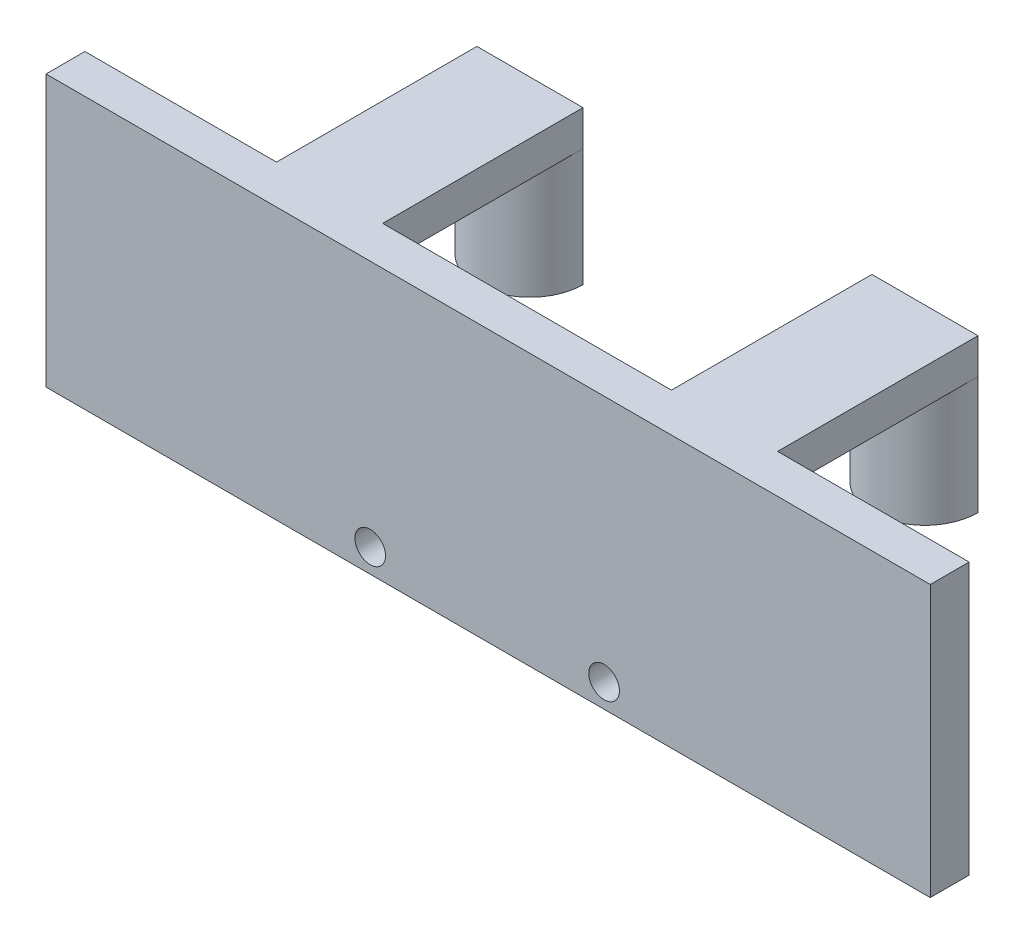
ISO-10303-21;
HEADER;
FILE_DESCRIPTION(('STEP AP214'),'2;1');
FILE_NAME('part.step','',(''),(''),'','','');
FILE_SCHEMA(('AUTOMOTIVE_DESIGN { 1 0 10303 214 1 1 1 1 }'));
ENDSEC;
DATA;
#1=APPLICATION_CONTEXT('core data for automotive mechanical design processes');
#2=APPLICATION_PROTOCOL_DEFINITION('international standard','automotive_design',2000,#1);
#3=PRODUCT_CONTEXT('',#1,'mechanical');
#4=PRODUCT('Part','Part','',(#3));
#5=PRODUCT_RELATED_PRODUCT_CATEGORY('part','',(#4));
#6=PRODUCT_DEFINITION_FORMATION('','',#4);
#7=PRODUCT_DEFINITION_CONTEXT('part definition',#1,'design');
#8=PRODUCT_DEFINITION('design','',#6,#7);
#9=PRODUCT_DEFINITION_SHAPE('','',#8);
#10=(LENGTH_UNIT() NAMED_UNIT(*) SI_UNIT(.MILLI.,.METRE.));
#11=(NAMED_UNIT(*) PLANE_ANGLE_UNIT() SI_UNIT($,.RADIAN.));
#12=(NAMED_UNIT(*) SI_UNIT($,.STERADIAN.) SOLID_ANGLE_UNIT());
#13=UNCERTAINTY_MEASURE_WITH_UNIT(LENGTH_MEASURE(1.E-05),#10,'distance_accuracy_value','');
#14=(GEOMETRIC_REPRESENTATION_CONTEXT(3) GLOBAL_UNCERTAINTY_ASSIGNED_CONTEXT((#13)) GLOBAL_UNIT_ASSIGNED_CONTEXT((#10,
#11,#12)) REPRESENTATION_CONTEXT('',''));
#15=CARTESIAN_POINT('',(0.,0.,0.));
#16=DIRECTION('',(0.,0.,1.));
#17=DIRECTION('',(1.,0.,0.));
#18=AXIS2_PLACEMENT_3D('',#15,#16,#17);
#19=CARTESIAN_POINT('',(0.,23.,-3.29999999999999));
#20=DIRECTION('',(-1.,0.,0.));
#21=DIRECTION('',(0.,0.,1.));
#22=AXIS2_PLACEMENT_3D('',#19,#20,#21);
#23=PLANE('',#22);
#24=DIRECTION('',(0.,0.,1.));
#25=VECTOR('',#24,1.);
#26=CARTESIAN_POINT('',(0.,20.,0.));
#27=LINE('',#26,#25);
#28=CARTESIAN_POINT('',(0.,20.,-20.3));
#29=VERTEX_POINT('',#28);
#30=CARTESIAN_POINT('',(0.,20.,-3.29999999999999));
#31=VERTEX_POINT('',#30);
#32=EDGE_CURVE('E155',#29,#31,#27,.T.);
#33=ORIENTED_EDGE('',*,*,#32,.F.);
#34=DIRECTION('',(0.,-1.,0.));
#35=VECTOR('',#34,1.);
#36=CARTESIAN_POINT('',(0.,23.,-20.3));
#37=LINE('',#36,#35);
#38=CARTESIAN_POINT('',(0.,23.,-20.3));
#39=VERTEX_POINT('',#38);
#40=EDGE_CURVE('E221',#39,#29,#37,.T.);
#41=ORIENTED_EDGE('',*,*,#40,.F.);
#42=DIRECTION('',(0.,0.,-1.));
#43=VECTOR('',#42,1.);
#44=CARTESIAN_POINT('',(0.,23.,-3.29999999999999));
#45=LINE('',#44,#43);
#46=CARTESIAN_POINT('',(0.,23.,-3.29999999999999));
#47=VERTEX_POINT('',#46);
#48=EDGE_CURVE('E170',#47,#39,#45,.T.);
#49=ORIENTED_EDGE('',*,*,#48,.F.);
#50=DIRECTION('',(0.,-1.,0.));
#51=VECTOR('',#50,1.);
#52=CARTESIAN_POINT('',(0.,23.,-3.29999999999999));
#53=LINE('',#52,#51);
#54=EDGE_CURVE('E224',#47,#31,#53,.T.);
#55=ORIENTED_EDGE('',*,*,#54,.T.);
#56=EDGE_LOOP('',(#33,#41,#49,#55));
#57=FACE_BOUND('',#56,.T.);
#58=ADVANCED_FACE('F36',(#57),#23,.F.);
#59=CARTESIAN_POINT('',(-9.,23.,-20.3));
#60=DIRECTION('',(1.,0.,0.));
#61=DIRECTION('',(0.,0.,-1.));
#62=AXIS2_PLACEMENT_3D('',#59,#60,#61);
#63=PLANE('',#62);
#64=DIRECTION('',(0.,0.,-1.));
#65=VECTOR('',#64,1.);
#66=CARTESIAN_POINT('',(-9.,20.,0.));
#67=LINE('',#66,#65);
#68=CARTESIAN_POINT('',(-9.,20.,-3.29999999999999));
#69=VERTEX_POINT('',#68);
#70=CARTESIAN_POINT('',(-9.,20.,-20.3));
#71=VERTEX_POINT('',#70);
#72=EDGE_CURVE('E267',#69,#71,#67,.T.);
#73=ORIENTED_EDGE('',*,*,#72,.F.);
#74=DIRECTION('',(0.,-1.,0.));
#75=VECTOR('',#74,1.);
#76=CARTESIAN_POINT('',(-9.,23.,-3.29999999999999));
#77=LINE('',#76,#75);
#78=CARTESIAN_POINT('',(-9.,23.,-3.29999999999999));
#79=VERTEX_POINT('',#78);
#80=EDGE_CURVE('E215',#79,#69,#77,.T.);
#81=ORIENTED_EDGE('',*,*,#80,.F.);
#82=DIRECTION('',(0.,0.,1.));
#83=VECTOR('',#82,1.);
#84=CARTESIAN_POINT('',(-9.,23.,-20.3));
#85=LINE('',#84,#83);
#86=CARTESIAN_POINT('',(-9.,23.,-20.3));
#87=VERTEX_POINT('',#86);
#88=EDGE_CURVE('E174',#87,#79,#85,.T.);
#89=ORIENTED_EDGE('',*,*,#88,.F.);
#90=DIRECTION('',(0.,-1.,0.));
#91=VECTOR('',#90,1.);
#92=CARTESIAN_POINT('',(-9.,23.,-20.3));
#93=LINE('',#92,#91);
#94=EDGE_CURVE('E218',#87,#71,#93,.T.);
#95=ORIENTED_EDGE('',*,*,#94,.T.);
#96=EDGE_LOOP('',(#73,#81,#89,#95));
#97=FACE_BOUND('',#96,.T.);
#98=ADVANCED_FACE('F314',(#97),#63,.F.);
#99=CARTESIAN_POINT('',(-33.5,23.,-20.3));
#100=DIRECTION('',(-1.,0.,0.));
#101=DIRECTION('',(0.,0.,1.));
#102=AXIS2_PLACEMENT_3D('',#99,#100,#101);
#103=PLANE('',#102);
#104=DIRECTION('',(0.,0.,1.));
#105=VECTOR('',#104,1.);
#106=CARTESIAN_POINT('',(-33.5,20.,0.));
#107=LINE('',#106,#105);
#108=CARTESIAN_POINT('',(-33.5,20.,-20.3));
#109=VERTEX_POINT('',#108);
#110=CARTESIAN_POINT('',(-33.5,20.,-3.29999999999999));
#111=VERTEX_POINT('',#110);
#112=EDGE_CURVE('E259',#109,#111,#107,.T.);
#113=ORIENTED_EDGE('',*,*,#112,.F.);
#114=DIRECTION('',(0.,-1.,0.));
#115=VECTOR('',#114,1.);
#116=CARTESIAN_POINT('',(-33.5,23.,-20.3));
#117=LINE('',#116,#115);
#118=CARTESIAN_POINT('',(-33.5,23.,-20.3));
#119=VERTEX_POINT('',#118);
#120=EDGE_CURVE('E210',#119,#109,#117,.T.);
#121=ORIENTED_EDGE('',*,*,#120,.F.);
#122=DIRECTION('',(0.,0.,-1.));
#123=VECTOR('',#122,1.);
#124=CARTESIAN_POINT('',(-33.5,23.,-20.3));
#125=LINE('',#124,#123);
#126=CARTESIAN_POINT('',(-33.5,23.,-3.29999999999999));
#127=VERTEX_POINT('',#126);
#128=EDGE_CURVE('E178',#127,#119,#125,.T.);
#129=ORIENTED_EDGE('',*,*,#128,.F.);
#130=DIRECTION('',(0.,-1.,0.));
#131=VECTOR('',#130,1.);
#132=CARTESIAN_POINT('',(-33.5,23.,-3.29999999999999));
#133=LINE('',#132,#131);
#134=EDGE_CURVE('E212',#127,#111,#133,.T.);
#135=ORIENTED_EDGE('',*,*,#134,.T.);
#136=EDGE_LOOP('',(#113,#121,#129,#135));
#137=FACE_BOUND('',#136,.T.);
#138=ADVANCED_FACE('F319',(#137),#103,.F.);
#139=CARTESIAN_POINT('',(-42.5,23.,-3.29999999999999));
#140=DIRECTION('',(1.,0.,0.));
#141=DIRECTION('',(0.,0.,-1.));
#142=AXIS2_PLACEMENT_3D('',#139,#140,#141);
#143=PLANE('',#142);
#144=DIRECTION('',(0.,0.,-1.));
#145=VECTOR('',#144,1.);
#146=CARTESIAN_POINT('',(-42.5,20.,0.));
#147=LINE('',#146,#145);
#148=CARTESIAN_POINT('',(-42.5,20.,-3.29999999999999));
#149=VERTEX_POINT('',#148);
#150=CARTESIAN_POINT('',(-42.5,20.,-20.3));
#151=VERTEX_POINT('',#150);
#152=EDGE_CURVE('E157',#149,#151,#147,.T.);
#153=ORIENTED_EDGE('',*,*,#152,.F.);
#154=DIRECTION('',(0.,-1.,0.));
#155=VECTOR('',#154,1.);
#156=CARTESIAN_POINT('',(-42.5,23.,-3.29999999999999));
#157=LINE('',#156,#155);
#158=CARTESIAN_POINT('',(-42.5,23.,-3.29999999999999));
#159=VERTEX_POINT('',#158);
#160=EDGE_CURVE('E205',#159,#149,#157,.T.);
#161=ORIENTED_EDGE('',*,*,#160,.F.);
#162=DIRECTION('',(0.,0.,1.));
#163=VECTOR('',#162,1.);
#164=CARTESIAN_POINT('',(-42.5,23.,-3.29999999999999));
#165=LINE('',#164,#163);
#166=CARTESIAN_POINT('',(-42.5,23.,-20.3));
#167=VERTEX_POINT('',#166);
#168=EDGE_CURVE('E182',#167,#159,#165,.T.);
#169=ORIENTED_EDGE('',*,*,#168,.F.);
#170=DIRECTION('',(0.,-1.,0.));
#171=VECTOR('',#170,1.);
#172=CARTESIAN_POINT('',(-42.5,23.,-20.3));
#173=LINE('',#172,#171);
#174=EDGE_CURVE('E208',#167,#151,#173,.T.);
#175=ORIENTED_EDGE('',*,*,#174,.T.);
#176=EDGE_LOOP('',(#153,#161,#169,#175));
#177=FACE_BOUND('',#176,.T.);
#178=ADVANCED_FACE('F257',(#177),#143,.F.);
#179=CARTESIAN_POINT('',(0.,0.,0.));
#180=DIRECTION('',(0.,-1.,0.));
#181=DIRECTION('',(0.,0.,-1.));
#182=AXIS2_PLACEMENT_3D('',#179,#180,#181);
#183=PLANE('',#182);
#184=DIRECTION('',(-1.,0.,0.));
#185=VECTOR('',#184,1.);
#186=CARTESIAN_POINT('',(-42.5,0.,-3.29999999999999));
#187=LINE('',#186,#185);
#188=CARTESIAN_POINT('',(16.25,0.,-3.29999999999999));
#189=VERTEX_POINT('',#188);
#190=CARTESIAN_POINT('',(-58.75,0.,-3.29999999999999));
#191=VERTEX_POINT('',#190);
#192=EDGE_CURVE('E193',#189,#191,#187,.T.);
#193=ORIENTED_EDGE('',*,*,#192,.F.);
#194=DIRECTION('',(0.,0.,-1.));
#195=VECTOR('',#194,1.);
#196=CARTESIAN_POINT('',(16.25,0.,-3.29999999999999));
#197=LINE('',#196,#195);
#198=CARTESIAN_POINT('',(16.25,0.,0.));
#199=VERTEX_POINT('',#198);
#200=EDGE_CURVE('E190',#199,#189,#197,.T.);
#201=ORIENTED_EDGE('',*,*,#200,.F.);
#202=DIRECTION('',(1.,0.,0.));
#203=VECTOR('',#202,1.);
#204=CARTESIAN_POINT('',(0.,0.,0.));
#205=LINE('',#204,#203);
#206=CARTESIAN_POINT('',(-58.75,0.,0.));
#207=VERTEX_POINT('',#206);
#208=EDGE_CURVE('E166',#207,#199,#205,.T.);
#209=ORIENTED_EDGE('',*,*,#208,.F.);
#210=DIRECTION('',(0.,0.,1.));
#211=VECTOR('',#210,1.);
#212=CARTESIAN_POINT('',(-58.75,0.,-3.29999999999999));
#213=LINE('',#212,#211);
#214=EDGE_CURVE('E196',#191,#207,#213,.T.);
#215=ORIENTED_EDGE('',*,*,#214,.F.);
#216=EDGE_LOOP('',(#193,#201,#209,#215));
#217=FACE_BOUND('',#216,.T.);
#218=ADVANCED_FACE('F239',(#217),#183,.T.);
#219=CARTESIAN_POINT('',(16.25,23.,-3.29999999999999));
#220=DIRECTION('',(-1.,0.,0.));
#221=DIRECTION('',(0.,0.,1.));
#222=AXIS2_PLACEMENT_3D('',#219,#220,#221);
#223=PLANE('',#222);
#224=ORIENTED_EDGE('',*,*,#200,.T.);
#225=DIRECTION('',(0.,-1.,0.));
#226=VECTOR('',#225,1.);
#227=CARTESIAN_POINT('',(16.25,23.,-3.29999999999999));
#228=LINE('',#227,#226);
#229=CARTESIAN_POINT('',(16.25,23.,-3.29999999999999));
#230=VERTEX_POINT('',#229);
#231=EDGE_CURVE('E227',#230,#189,#228,.T.);
#232=ORIENTED_EDGE('',*,*,#231,.F.);
#233=DIRECTION('',(0.,0.,-1.));
#234=VECTOR('',#233,1.);
#235=CARTESIAN_POINT('',(16.25,23.,-3.29999999999999));
#236=LINE('',#235,#234);
#237=CARTESIAN_POINT('',(16.25,23.,0.));
#238=VERTEX_POINT('',#237);
#239=EDGE_CURVE('E165',#238,#230,#236,.T.);
#240=ORIENTED_EDGE('',*,*,#239,.F.);
#241=DIRECTION('',(0.,-1.,0.));
#242=VECTOR('',#241,1.);
#243=CARTESIAN_POINT('',(16.25,23.,0.));
#244=LINE('',#243,#242);
#245=EDGE_CURVE('E44',#238,#199,#244,.T.);
#246=ORIENTED_EDGE('',*,*,#245,.T.);
#247=EDGE_LOOP('',(#224,#232,#240,#246));
#248=FACE_BOUND('',#247,.T.);
#249=ADVANCED_FACE('F38',(#248),#223,.F.);
#250=CARTESIAN_POINT('',(0.,23.,-20.3));
#251=DIRECTION('',(0.,0.,1.));
#252=DIRECTION('',(1.,0.,0.));
#253=AXIS2_PLACEMENT_3D('',#250,#251,#252);
#254=PLANE('',#253);
#255=DIRECTION('',(0.,-1.,0.));
#256=VECTOR('',#255,1.);
#257=CARTESIAN_POINT('',(0.,20.,-20.3));
#258=LINE('',#257,#256);
#259=CARTESIAN_POINT('',(0.,10.,-20.3));
#260=VERTEX_POINT('',#259);
#261=EDGE_CURVE('E264',#29,#260,#258,.T.);
#262=ORIENTED_EDGE('',*,*,#261,.T.);
#263=DIRECTION('',(1.,0.,0.));
#264=VECTOR('',#263,1.);
#265=CARTESIAN_POINT('',(-42.5,10.,-20.3));
#266=LINE('',#265,#264);
#267=CARTESIAN_POINT('',(-9.,10.,-20.3));
#268=VERTEX_POINT('',#267);
#269=EDGE_CURVE('E56',#268,#260,#266,.T.);
#270=ORIENTED_EDGE('',*,*,#269,.F.);
#271=DIRECTION('',(0.,-1.,0.));
#272=VECTOR('',#271,1.);
#273=CARTESIAN_POINT('',(-9.,20.,-20.3));
#274=LINE('',#273,#272);
#275=EDGE_CURVE('E194',#71,#268,#274,.T.);
#276=ORIENTED_EDGE('',*,*,#275,.F.);
#277=ORIENTED_EDGE('',*,*,#94,.F.);
#278=DIRECTION('',(-1.,0.,0.));
#279=VECTOR('',#278,1.);
#280=CARTESIAN_POINT('',(0.,23.,-20.3));
#281=LINE('',#280,#279);
#282=EDGE_CURVE('E172',#39,#87,#281,.T.);
#283=ORIENTED_EDGE('',*,*,#282,.F.);
#284=ORIENTED_EDGE('',*,*,#40,.T.);
#285=EDGE_LOOP('',(#262,#270,#276,#277,#283,#284));
#286=FACE_BOUND('',#285,.T.);
#287=ADVANCED_FACE('F310',(#286),#254,.F.);
#288=CARTESIAN_POINT('',(-42.5,23.,-20.3));
#289=DIRECTION('',(0.,0.,1.));
#290=DIRECTION('',(1.,0.,0.));
#291=AXIS2_PLACEMENT_3D('',#288,#289,#290);
#292=PLANE('',#291);
#293=DIRECTION('',(0.,-1.,0.));
#294=VECTOR('',#293,1.);
#295=CARTESIAN_POINT('',(-33.5,20.,-20.3));
#296=LINE('',#295,#294);
#297=CARTESIAN_POINT('',(-33.5,10.,-20.3));
#298=VERTEX_POINT('',#297);
#299=EDGE_CURVE('E147',#109,#298,#296,.T.);
#300=ORIENTED_EDGE('',*,*,#299,.T.);
#301=CARTESIAN_POINT('',(-42.5,10.,-20.3));
#302=VERTEX_POINT('',#301);
#303=EDGE_CURVE('E50',#302,#298,#266,.T.);
#304=ORIENTED_EDGE('',*,*,#303,.F.);
#305=DIRECTION('',(0.,-1.,0.));
#306=VECTOR('',#305,1.);
#307=CARTESIAN_POINT('',(-42.5,20.,-20.3));
#308=LINE('',#307,#306);
#309=EDGE_CURVE('E144',#151,#302,#308,.T.);
#310=ORIENTED_EDGE('',*,*,#309,.F.);
#311=ORIENTED_EDGE('',*,*,#174,.F.);
#312=DIRECTION('',(-1.,0.,0.));
#313=VECTOR('',#312,1.);
#314=CARTESIAN_POINT('',(-42.5,23.,-20.3));
#315=LINE('',#314,#313);
#316=EDGE_CURVE('E180',#119,#167,#315,.T.);
#317=ORIENTED_EDGE('',*,*,#316,.F.);
#318=ORIENTED_EDGE('',*,*,#120,.T.);
#319=EDGE_LOOP('',(#300,#304,#310,#311,#317,#318));
#320=FACE_BOUND('',#319,.T.);
#321=ADVANCED_FACE('F142',(#320),#292,.F.);
#322=CARTESIAN_POINT('',(-42.5,23.,-3.29999999999999));
#323=DIRECTION('',(0.,0.,1.));
#324=DIRECTION('',(1.,0.,0.));
#325=AXIS2_PLACEMENT_3D('',#322,#323,#324);
#326=PLANE('',#325);
#327=CARTESIAN_POINT('',(-31.2499999999903,2.,-3.29999999999999));
#328=DIRECTION('',(0.,0.,1.));
#329=DIRECTION('',(1.,0.,0.));
#330=AXIS2_PLACEMENT_3D('',#327,#328,#329);
#331=CIRCLE('',#330,1.3);
#332=CARTESIAN_POINT('',(-29.9499999999904,2.,-3.29999999999999));
#333=VERTEX_POINT('',#332);
#334=EDGE_CURVE('E263',#333,#333,#331,.T.);
#335=ORIENTED_EDGE('',*,*,#334,.T.);
#336=EDGE_LOOP('',(#335));
#337=FACE_BOUND('',#336,.T.);
#338=CARTESIAN_POINT('',(-11.4139906101707,2.,-3.29999999999999));
#339=DIRECTION('',(0.,0.,1.));
#340=DIRECTION('',(1.,0.,0.));
#341=AXIS2_PLACEMENT_3D('',#338,#339,#340);
#342=CIRCLE('',#341,1.3);
#343=CARTESIAN_POINT('',(-10.1139906101707,2.,-3.29999999999999));
#344=VERTEX_POINT('',#343);
#345=EDGE_CURVE('E278',#344,#344,#342,.T.);
#346=ORIENTED_EDGE('',*,*,#345,.T.);
#347=EDGE_LOOP('',(#346));
#348=FACE_BOUND('',#347,.T.);
#349=ORIENTED_EDGE('',*,*,#192,.T.);
#350=DIRECTION('',(0.,-1.,0.));
#351=VECTOR('',#350,1.);
#352=CARTESIAN_POINT('',(-58.75,23.,-3.29999999999999));
#353=LINE('',#352,#351);
#354=CARTESIAN_POINT('',(-58.75,23.,-3.29999999999999));
#355=VERTEX_POINT('',#354);
#356=EDGE_CURVE('E202',#355,#191,#353,.T.);
#357=ORIENTED_EDGE('',*,*,#356,.F.);
#358=DIRECTION('',(-1.,0.,0.));
#359=VECTOR('',#358,1.);
#360=CARTESIAN_POINT('',(-42.5,23.,-3.29999999999999));
#361=LINE('',#360,#359);
#362=EDGE_CURVE('E184',#159,#355,#361,.T.);
#363=ORIENTED_EDGE('',*,*,#362,.F.);
#364=ORIENTED_EDGE('',*,*,#160,.T.);
#365=DIRECTION('',(-1.,0.,0.));
#366=VECTOR('',#365,1.);
#367=CARTESIAN_POINT('',(0.,20.,-3.29999999999999));
#368=LINE('',#367,#366);
#369=EDGE_CURVE('E253',#111,#149,#368,.T.);
#370=ORIENTED_EDGE('',*,*,#369,.F.);
#371=ORIENTED_EDGE('',*,*,#134,.F.);
#372=DIRECTION('',(-1.,0.,0.));
#373=VECTOR('',#372,1.);
#374=CARTESIAN_POINT('',(-33.5,23.,-3.29999999999999));
#375=LINE('',#374,#373);
#376=EDGE_CURVE('E176',#79,#127,#375,.T.);
#377=ORIENTED_EDGE('',*,*,#376,.F.);
#378=ORIENTED_EDGE('',*,*,#80,.T.);
#379=DIRECTION('',(1.,0.,0.));
#380=VECTOR('',#379,1.);
#381=CARTESIAN_POINT('',(0.,20.,-3.29999999999999));
#382=LINE('',#381,#380);
#383=EDGE_CURVE('E272',#69,#31,#382,.T.);
#384=ORIENTED_EDGE('',*,*,#383,.T.);
#385=ORIENTED_EDGE('',*,*,#54,.F.);
#386=DIRECTION('',(-1.,0.,0.));
#387=VECTOR('',#386,1.);
#388=CARTESIAN_POINT('',(0.,23.,-3.29999999999999));
#389=LINE('',#388,#387);
#390=EDGE_CURVE('E168',#230,#47,#389,.T.);
#391=ORIENTED_EDGE('',*,*,#390,.F.);
#392=ORIENTED_EDGE('',*,*,#231,.T.);
#393=EDGE_LOOP('',(#349,#357,#363,#364,#370,#371,#377,#378,#384,#385,#391,#392));
#394=FACE_BOUND('',#393,.T.);
#395=ADVANCED_FACE('F242',(#337,#348,#394),#326,.F.);
#396=CARTESIAN_POINT('',(-58.75,23.,-3.29999999999999));
#397=DIRECTION('',(1.,0.,0.));
#398=DIRECTION('',(0.,0.,-1.));
#399=AXIS2_PLACEMENT_3D('',#396,#397,#398);
#400=PLANE('',#399);
#401=ORIENTED_EDGE('',*,*,#214,.T.);
#402=DIRECTION('',(0.,-1.,0.));
#403=VECTOR('',#402,1.);
#404=CARTESIAN_POINT('',(-58.75,23.,0.));
#405=LINE('',#404,#403);
#406=CARTESIAN_POINT('',(-58.75,23.,0.));
#407=VERTEX_POINT('',#406);
#408=EDGE_CURVE('E189',#407,#207,#405,.T.);
#409=ORIENTED_EDGE('',*,*,#408,.F.);
#410=DIRECTION('',(0.,0.,1.));
#411=VECTOR('',#410,1.);
#412=CARTESIAN_POINT('',(-58.75,23.,-3.29999999999999));
#413=LINE('',#412,#411);
#414=EDGE_CURVE('E186',#355,#407,#413,.T.);
#415=ORIENTED_EDGE('',*,*,#414,.F.);
#416=ORIENTED_EDGE('',*,*,#356,.T.);
#417=EDGE_LOOP('',(#401,#409,#415,#416));
#418=FACE_BOUND('',#417,.T.);
#419=ADVANCED_FACE('F247',(#418),#400,.F.);
#420=CARTESIAN_POINT('',(0.,23.,0.));
#421=DIRECTION('',(0.,0.,-1.));
#422=DIRECTION('',(-1.,0.,0.));
#423=AXIS2_PLACEMENT_3D('',#420,#421,#422);
#424=PLANE('',#423);
#425=CARTESIAN_POINT('',(-31.2499999999903,2.,0.));
#426=DIRECTION('',(0.,0.,1.));
#427=DIRECTION('',(1.,0.,0.));
#428=AXIS2_PLACEMENT_3D('',#425,#426,#427);
#429=CIRCLE('',#428,1.3);
#430=CARTESIAN_POINT('',(-29.9499999999904,2.,0.));
#431=VERTEX_POINT('',#430);
#432=EDGE_CURVE('E281',#431,#431,#429,.T.);
#433=ORIENTED_EDGE('',*,*,#432,.F.);
#434=EDGE_LOOP('',(#433));
#435=FACE_BOUND('',#434,.T.);
#436=CARTESIAN_POINT('',(-11.4139906101707,2.,0.));
#437=DIRECTION('',(0.,0.,1.));
#438=DIRECTION('',(1.,0.,0.));
#439=AXIS2_PLACEMENT_3D('',#436,#437,#438);
#440=CIRCLE('',#439,1.3);
#441=CARTESIAN_POINT('',(-10.1139906101707,2.,0.));
#442=VERTEX_POINT('',#441);
#443=EDGE_CURVE('E138',#442,#442,#440,.T.);
#444=ORIENTED_EDGE('',*,*,#443,.F.);
#445=EDGE_LOOP('',(#444));
#446=FACE_BOUND('',#445,.T.);
#447=ORIENTED_EDGE('',*,*,#208,.T.);
#448=ORIENTED_EDGE('',*,*,#245,.F.);
#449=DIRECTION('',(1.,0.,0.));
#450=VECTOR('',#449,1.);
#451=CARTESIAN_POINT('',(0.,23.,0.));
#452=LINE('',#451,#450);
#453=EDGE_CURVE('E162',#407,#238,#452,.T.);
#454=ORIENTED_EDGE('',*,*,#453,.F.);
#455=ORIENTED_EDGE('',*,*,#408,.T.);
#456=EDGE_LOOP('',(#447,#448,#454,#455));
#457=FACE_BOUND('',#456,.T.);
#458=ADVANCED_FACE('F235',(#435,#446,#457),#424,.F.);
#459=CARTESIAN_POINT('',(0.,23.,0.));
#460=DIRECTION('',(0.,-1.,0.));
#461=DIRECTION('',(0.,0.,-1.));
#462=AXIS2_PLACEMENT_3D('',#459,#460,#461);
#463=PLANE('',#462);
#464=ORIENTED_EDGE('',*,*,#453,.T.);
#465=ORIENTED_EDGE('',*,*,#239,.T.);
#466=ORIENTED_EDGE('',*,*,#390,.T.);
#467=ORIENTED_EDGE('',*,*,#48,.T.);
#468=ORIENTED_EDGE('',*,*,#282,.T.);
#469=ORIENTED_EDGE('',*,*,#88,.T.);
#470=ORIENTED_EDGE('',*,*,#376,.T.);
#471=ORIENTED_EDGE('',*,*,#128,.T.);
#472=ORIENTED_EDGE('',*,*,#316,.T.);
#473=ORIENTED_EDGE('',*,*,#168,.T.);
#474=ORIENTED_EDGE('',*,*,#362,.T.);
#475=ORIENTED_EDGE('',*,*,#414,.T.);
#476=EDGE_LOOP('',(#464,#465,#466,#467,#468,#469,#470,#471,#472,#473,#474,#475));
#477=FACE_BOUND('',#476,.T.);
#478=ADVANCED_FACE('F249',(#477),#463,.F.);
#479=CARTESIAN_POINT('',(-38.,20.,-20.3));
#480=DIRECTION('',(0.,-1.,0.));
#481=DIRECTION('',(0.,0.,-1.));
#482=AXIS2_PLACEMENT_3D('',#479,#480,#481);
#483=CYLINDRICAL_SURFACE('',#482,4.5);
#484=CARTESIAN_POINT('',(-38.,10.,-20.3));
#485=DIRECTION('',(0.,1.,0.));
#486=DIRECTION('',(0.,0.,1.));
#487=AXIS2_PLACEMENT_3D('',#484,#485,#486);
#488=CIRCLE('',#487,4.5);
#489=EDGE_CURVE('E133',#298,#302,#488,.F.);
#490=ORIENTED_EDGE('',*,*,#489,.F.);
#491=ORIENTED_EDGE('',*,*,#299,.F.);
#492=CARTESIAN_POINT('',(-38.,20.,-20.3));
#493=DIRECTION('',(0.,-1.,0.));
#494=DIRECTION('',(0.,0.,-1.));
#495=AXIS2_PLACEMENT_3D('',#492,#493,#494);
#496=CIRCLE('',#495,4.5);
#497=EDGE_CURVE('E151',#109,#151,#496,.T.);
#498=ORIENTED_EDGE('',*,*,#497,.T.);
#499=ORIENTED_EDGE('',*,*,#309,.T.);
#500=EDGE_LOOP('',(#490,#491,#498,#499));
#501=FACE_BOUND('',#500,.T.);
#502=ADVANCED_FACE('F149',(#501),#483,.T.);
#503=CARTESIAN_POINT('',(0.,20.,0.));
#504=DIRECTION('',(0.,-1.,0.));
#505=DIRECTION('',(0.,0.,-1.));
#506=AXIS2_PLACEMENT_3D('',#503,#504,#505);
#507=PLANE('',#506);
#508=ORIENTED_EDGE('',*,*,#497,.F.);
#509=ORIENTED_EDGE('',*,*,#112,.T.);
#510=ORIENTED_EDGE('',*,*,#369,.T.);
#511=ORIENTED_EDGE('',*,*,#152,.T.);
#512=EDGE_LOOP('',(#508,#509,#510,#511));
#513=FACE_BOUND('',#512,.T.);
#514=ADVANCED_FACE('F342',(#513),#507,.T.);
#515=CARTESIAN_POINT('',(-4.5,20.,-20.3));
#516=DIRECTION('',(0.,-1.,0.));
#517=DIRECTION('',(0.,0.,-1.));
#518=AXIS2_PLACEMENT_3D('',#515,#516,#517);
#519=CYLINDRICAL_SURFACE('',#518,4.5);
#520=CARTESIAN_POINT('',(-4.5,10.,-20.3));
#521=DIRECTION('',(0.,1.,0.));
#522=DIRECTION('',(0.,0.,1.));
#523=AXIS2_PLACEMENT_3D('',#520,#521,#522);
#524=CIRCLE('',#523,4.5);
#525=EDGE_CURVE('E11',#260,#268,#524,.F.);
#526=ORIENTED_EDGE('',*,*,#525,.F.);
#527=ORIENTED_EDGE('',*,*,#261,.F.);
#528=CARTESIAN_POINT('',(-4.5,20.,-20.3));
#529=DIRECTION('',(0.,-1.,0.));
#530=DIRECTION('',(0.,0.,-1.));
#531=AXIS2_PLACEMENT_3D('',#528,#529,#530);
#532=CIRCLE('',#531,4.5);
#533=EDGE_CURVE('E153',#29,#71,#532,.T.);
#534=ORIENTED_EDGE('',*,*,#533,.T.);
#535=ORIENTED_EDGE('',*,*,#275,.T.);
#536=EDGE_LOOP('',(#526,#527,#534,#535));
#537=FACE_BOUND('',#536,.T.);
#538=ADVANCED_FACE('F345',(#537),#519,.T.);
#539=CARTESIAN_POINT('',(0.,20.,0.));
#540=DIRECTION('',(0.,-1.,0.));
#541=DIRECTION('',(0.,0.,-1.));
#542=AXIS2_PLACEMENT_3D('',#539,#540,#541);
#543=PLANE('',#542);
#544=ORIENTED_EDGE('',*,*,#533,.F.);
#545=ORIENTED_EDGE('',*,*,#32,.T.);
#546=ORIENTED_EDGE('',*,*,#383,.F.);
#547=ORIENTED_EDGE('',*,*,#72,.T.);
#548=EDGE_LOOP('',(#544,#545,#546,#547));
#549=FACE_BOUND('',#548,.T.);
#550=ADVANCED_FACE('F298',(#549),#543,.T.);
#551=CARTESIAN_POINT('',(-11.4139906101707,2.,-4.));
#552=DIRECTION('',(0.,0.,1.));
#553=DIRECTION('',(1.,0.,0.));
#554=AXIS2_PLACEMENT_3D('',#551,#552,#553);
#555=CYLINDRICAL_SURFACE('',#554,1.3);
#556=ORIENTED_EDGE('',*,*,#443,.T.);
#557=EDGE_LOOP('',(#556));
#558=FACE_BOUND('',#557,.T.);
#559=ORIENTED_EDGE('',*,*,#345,.F.);
#560=EDGE_LOOP('',(#559));
#561=FACE_BOUND('',#560,.T.);
#562=ADVANCED_FACE('F295',(#558,#561),#555,.F.);
#563=CARTESIAN_POINT('',(-31.2499999999903,2.,-4.));
#564=DIRECTION('',(0.,0.,1.));
#565=DIRECTION('',(1.,0.,0.));
#566=AXIS2_PLACEMENT_3D('',#563,#564,#565);
#567=CYLINDRICAL_SURFACE('',#566,1.3);
#568=ORIENTED_EDGE('',*,*,#432,.T.);
#569=EDGE_LOOP('',(#568));
#570=FACE_BOUND('',#569,.T.);
#571=ORIENTED_EDGE('',*,*,#334,.F.);
#572=EDGE_LOOP('',(#571));
#573=FACE_BOUND('',#572,.T.);
#574=ADVANCED_FACE('F287',(#570,#573),#567,.F.);
#575=CARTESIAN_POINT('',(0.,10.,0.));
#576=DIRECTION('',(0.,1.,0.));
#577=DIRECTION('',(0.,0.,1.));
#578=AXIS2_PLACEMENT_3D('',#575,#576,#577);
#579=PLANE('',#578);
#580=ORIENTED_EDGE('',*,*,#525,.T.);
#581=ORIENTED_EDGE('',*,*,#269,.T.);
#582=EDGE_LOOP('',(#580,#581));
#583=FACE_BOUND('',#582,.T.);
#584=ADVANCED_FACE('F354',(#583),#579,.F.);
#585=ORIENTED_EDGE('',*,*,#489,.T.);
#586=ORIENTED_EDGE('',*,*,#303,.T.);
#587=EDGE_LOOP('',(#585,#586));
#588=FACE_BOUND('',#587,.T.);
#589=ADVANCED_FACE('F134',(#588),#579,.F.);
#590=CLOSED_SHELL('',(#58,#98,#138,#178,#218,#249,#287,#321,#395,#419,#458,#478,#502,#514,#538,
#550,#562,#574,#584,#589));
#591=MANIFOLD_SOLID_BREP('B2',#590);
#592=ADVANCED_BREP_SHAPE_REPRESENTATION('',(#18,#591),#14);
#593=SHAPE_DEFINITION_REPRESENTATION(#9,#592);
ENDSEC;
END-ISO-10303-21;
